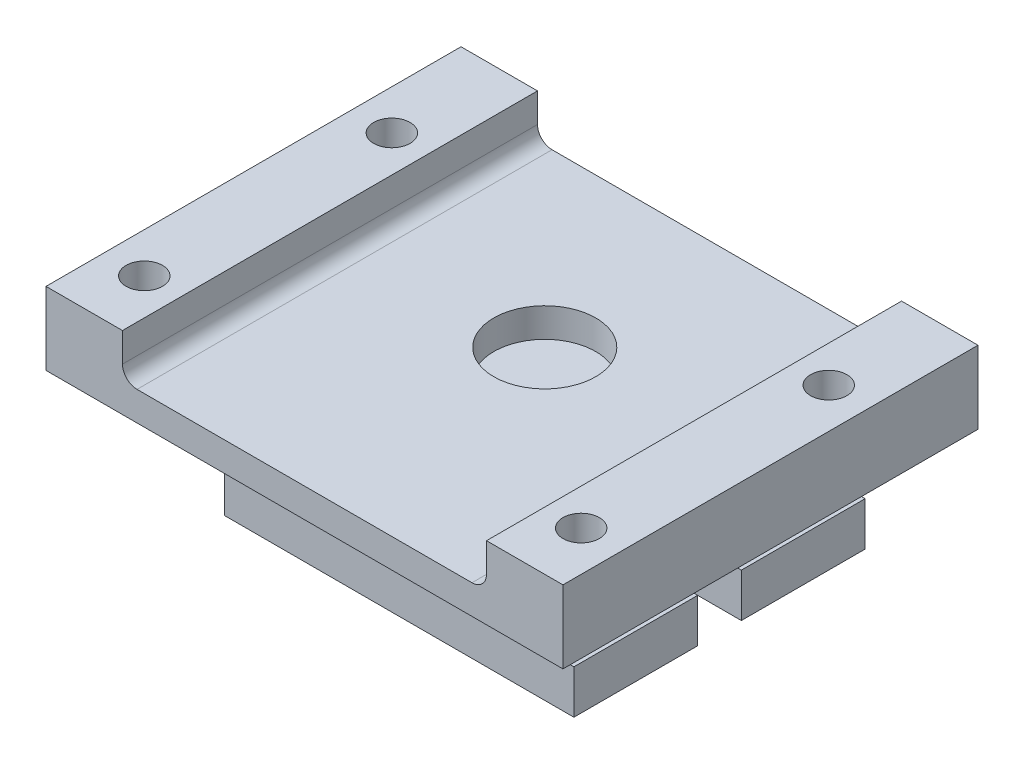
ISO-10303-21;
HEADER;
FILE_DESCRIPTION(('STEP AP214'),'2;1');
FILE_NAME('part.step','',(''),(''),'','','');
FILE_SCHEMA(('AUTOMOTIVE_DESIGN { 1 0 10303 214 1 1 1 1 }'));
ENDSEC;
DATA;
#1=APPLICATION_CONTEXT('core data for automotive mechanical design processes');
#2=APPLICATION_PROTOCOL_DEFINITION('international standard','automotive_design',2000,#1);
#3=PRODUCT_CONTEXT('',#1,'mechanical');
#4=PRODUCT('Part','Part','',(#3));
#5=PRODUCT_RELATED_PRODUCT_CATEGORY('part','',(#4));
#6=PRODUCT_DEFINITION_FORMATION('','',#4);
#7=PRODUCT_DEFINITION_CONTEXT('part definition',#1,'design');
#8=PRODUCT_DEFINITION('design','',#6,#7);
#9=PRODUCT_DEFINITION_SHAPE('','',#8);
#10=(LENGTH_UNIT() NAMED_UNIT(*) SI_UNIT(.MILLI.,.METRE.));
#11=(NAMED_UNIT(*) PLANE_ANGLE_UNIT() SI_UNIT($,.RADIAN.));
#12=(NAMED_UNIT(*) SI_UNIT($,.STERADIAN.) SOLID_ANGLE_UNIT());
#13=UNCERTAINTY_MEASURE_WITH_UNIT(LENGTH_MEASURE(1.E-05),#10,'distance_accuracy_value','');
#14=(GEOMETRIC_REPRESENTATION_CONTEXT(3) GLOBAL_UNCERTAINTY_ASSIGNED_CONTEXT((#13)) GLOBAL_UNIT_ASSIGNED_CONTEXT((#10,
#11,#12)) REPRESENTATION_CONTEXT('',''));
#15=CARTESIAN_POINT('',(0.,0.,0.));
#16=DIRECTION('',(0.,0.,1.));
#17=DIRECTION('',(1.,0.,0.));
#18=AXIS2_PLACEMENT_3D('',#15,#16,#17);
#19=CARTESIAN_POINT('',(0.,-9.,0.));
#20=DIRECTION('',(0.,-1.,0.));
#21=DIRECTION('',(0.,0.,-1.));
#22=AXIS2_PLACEMENT_3D('',#19,#20,#21);
#23=PLANE('',#22);
#24=DIRECTION('',(-1.,0.,0.));
#25=VECTOR('',#24,1.);
#26=CARTESIAN_POINT('',(17.75,-9.,1.5));
#27=LINE('',#26,#25);
#28=CARTESIAN_POINT('',(12.,-9.,1.5));
#29=VERTEX_POINT('',#28);
#30=CARTESIAN_POINT('',(-12.,-9.,1.5));
#31=VERTEX_POINT('',#30);
#32=EDGE_CURVE('E277',#29,#31,#27,.T.);
#33=ORIENTED_EDGE('',*,*,#32,.F.);
#34=DIRECTION('',(0.,0.,-1.));
#35=VECTOR('',#34,1.);
#36=CARTESIAN_POINT('',(12.,-9.,16.5));
#37=LINE('',#36,#35);
#38=CARTESIAN_POINT('',(12.,-9.,10.));
#39=VERTEX_POINT('',#38);
#40=EDGE_CURVE('E317',#39,#29,#37,.T.);
#41=ORIENTED_EDGE('',*,*,#40,.F.);
#42=DIRECTION('',(1.,0.,0.));
#43=VECTOR('',#42,1.);
#44=CARTESIAN_POINT('',(0.,-9.,9.99999999999999));
#45=LINE('',#44,#43);
#46=CARTESIAN_POINT('',(-12.,-9.,10.));
#47=VERTEX_POINT('',#46);
#48=EDGE_CURVE('E324',#47,#39,#45,.T.);
#49=ORIENTED_EDGE('',*,*,#48,.F.);
#50=DIRECTION('',(0.,0.,-1.));
#51=VECTOR('',#50,1.);
#52=CARTESIAN_POINT('',(-12.,-9.,16.5));
#53=LINE('',#52,#51);
#54=EDGE_CURVE('E297',#47,#31,#53,.T.);
#55=ORIENTED_EDGE('',*,*,#54,.T.);
#56=EDGE_LOOP('',(#33,#41,#49,#55));
#57=FACE_BOUND('',#56,.T.);
#58=ADVANCED_FACE('F80',(#57),#23,.T.);
#59=CARTESIAN_POINT('',(0.,-5.99999999999999,16.5));
#60=DIRECTION('',(0.,-1.,0.));
#61=DIRECTION('',(1.,0.,0.));
#62=AXIS2_PLACEMENT_3D('',#59,#60,#61);
#63=PLANE('',#62);
#64=DIRECTION('',(0.,0.,-1.));
#65=VECTOR('',#64,1.);
#66=CARTESIAN_POINT('',(-9.,-6.,16.5));
#67=LINE('',#66,#65);
#68=CARTESIAN_POINT('',(-9.,-6.,10.));
#69=VERTEX_POINT('',#68);
#70=CARTESIAN_POINT('',(-9.,-6.,1.5));
#71=VERTEX_POINT('',#70);
#72=EDGE_CURVE('E288',#69,#71,#67,.T.);
#73=ORIENTED_EDGE('',*,*,#72,.T.);
#74=DIRECTION('',(-1.,0.,0.));
#75=VECTOR('',#74,1.);
#76=CARTESIAN_POINT('',(17.75,-6.,1.5));
#77=LINE('',#76,#75);
#78=CARTESIAN_POINT('',(-12.,-6.,1.5));
#79=VERTEX_POINT('',#78);
#80=EDGE_CURVE('E274',#71,#79,#77,.T.);
#81=ORIENTED_EDGE('',*,*,#80,.T.);
#82=DIRECTION('',(0.,0.,-1.));
#83=VECTOR('',#82,1.);
#84=CARTESIAN_POINT('',(-12.,-6.,16.5));
#85=LINE('',#84,#83);
#86=CARTESIAN_POINT('',(-12.,-6.,10.));
#87=VERTEX_POINT('',#86);
#88=EDGE_CURVE('E286',#87,#79,#85,.T.);
#89=ORIENTED_EDGE('',*,*,#88,.F.);
#90=DIRECTION('',(1.,0.,0.));
#91=VECTOR('',#90,1.);
#92=CARTESIAN_POINT('',(0.,-5.99999999999999,9.99999999999999));
#93=LINE('',#92,#91);
#94=EDGE_CURVE('E443',#87,#69,#93,.T.);
#95=ORIENTED_EDGE('',*,*,#94,.T.);
#96=EDGE_LOOP('',(#73,#81,#89,#95));
#97=FACE_BOUND('',#96,.T.);
#98=ADVANCED_FACE('F285',(#97),#63,.F.);
#99=CARTESIAN_POINT('',(-12.,0.,16.5));
#100=DIRECTION('',(1.,0.,0.));
#101=DIRECTION('',(0.,0.,-1.));
#102=AXIS2_PLACEMENT_3D('',#99,#100,#101);
#103=PLANE('',#102);
#104=ORIENTED_EDGE('',*,*,#88,.T.);
#105=DIRECTION('',(0.,1.,0.));
#106=VECTOR('',#105,1.);
#107=CARTESIAN_POINT('',(-12.,-9.,1.5));
#108=LINE('',#107,#106);
#109=EDGE_CURVE('E271',#31,#79,#108,.T.);
#110=ORIENTED_EDGE('',*,*,#109,.F.);
#111=ORIENTED_EDGE('',*,*,#54,.F.);
#112=DIRECTION('',(0.,1.,0.));
#113=VECTOR('',#112,1.);
#114=CARTESIAN_POINT('',(-12.,-9.,9.99999999999999));
#115=LINE('',#114,#113);
#116=EDGE_CURVE('E293',#47,#87,#115,.T.);
#117=ORIENTED_EDGE('',*,*,#116,.T.);
#118=EDGE_LOOP('',(#104,#110,#111,#117));
#119=FACE_BOUND('',#118,.T.);
#120=ADVANCED_FACE('F291',(#119),#103,.F.);
#121=CARTESIAN_POINT('',(0.,-5.99999999999999,16.5));
#122=DIRECTION('',(0.,-1.,0.));
#123=DIRECTION('',(1.,0.,0.));
#124=AXIS2_PLACEMENT_3D('',#121,#122,#123);
#125=PLANE('',#124);
#126=DIRECTION('',(0.,0.,-1.));
#127=VECTOR('',#126,1.);
#128=CARTESIAN_POINT('',(12.,-6.,16.5));
#129=LINE('',#128,#127);
#130=CARTESIAN_POINT('',(12.,-6.,10.));
#131=VERTEX_POINT('',#130);
#132=CARTESIAN_POINT('',(12.,-6.,1.5));
#133=VERTEX_POINT('',#132);
#134=EDGE_CURVE('E312',#131,#133,#129,.T.);
#135=ORIENTED_EDGE('',*,*,#134,.T.);
#136=CARTESIAN_POINT('',(8.99999999999999,-6.,1.5));
#137=VERTEX_POINT('',#136);
#138=EDGE_CURVE('E289',#133,#137,#77,.T.);
#139=ORIENTED_EDGE('',*,*,#138,.T.);
#140=DIRECTION('',(0.,0.,-1.));
#141=VECTOR('',#140,1.);
#142=CARTESIAN_POINT('',(8.99999999999999,-6.,16.5));
#143=LINE('',#142,#141);
#144=CARTESIAN_POINT('',(8.99999999999999,-6.,10.));
#145=VERTEX_POINT('',#144);
#146=EDGE_CURVE('E321',#145,#137,#143,.T.);
#147=ORIENTED_EDGE('',*,*,#146,.F.);
#148=DIRECTION('',(1.,0.,0.));
#149=VECTOR('',#148,1.);
#150=CARTESIAN_POINT('',(0.,-5.99999999999999,9.99999999999999));
#151=LINE('',#150,#149);
#152=EDGE_CURVE('E438',#145,#131,#151,.T.);
#153=ORIENTED_EDGE('',*,*,#152,.T.);
#154=EDGE_LOOP('',(#135,#139,#147,#153));
#155=FACE_BOUND('',#154,.T.);
#156=ADVANCED_FACE('F504',(#155),#125,.F.);
#157=CARTESIAN_POINT('',(12.,0.,16.5));
#158=DIRECTION('',(-1.,0.,0.));
#159=DIRECTION('',(0.,0.,1.));
#160=AXIS2_PLACEMENT_3D('',#157,#158,#159);
#161=PLANE('',#160);
#162=ORIENTED_EDGE('',*,*,#40,.T.);
#163=DIRECTION('',(0.,1.,0.));
#164=VECTOR('',#163,1.);
#165=CARTESIAN_POINT('',(12.,0.,1.5));
#166=LINE('',#165,#164);
#167=EDGE_CURVE('E451',#29,#133,#166,.T.);
#168=ORIENTED_EDGE('',*,*,#167,.T.);
#169=ORIENTED_EDGE('',*,*,#134,.F.);
#170=DIRECTION('',(0.,-1.,0.));
#171=VECTOR('',#170,1.);
#172=CARTESIAN_POINT('',(12.,-9.,9.99999999999999));
#173=LINE('',#172,#171);
#174=EDGE_CURVE('E440',#131,#39,#173,.T.);
#175=ORIENTED_EDGE('',*,*,#174,.T.);
#176=EDGE_LOOP('',(#162,#168,#169,#175));
#177=FACE_BOUND('',#176,.T.);
#178=ADVANCED_FACE('F597',(#177),#161,.F.);
#179=CARTESIAN_POINT('',(0.,5.,0.));
#180=DIRECTION('',(0.,1.,0.));
#181=DIRECTION('',(0.,0.,1.));
#182=AXIS2_PLACEMENT_3D('',#179,#180,#181);
#183=PLANE('',#182);
#184=DIRECTION('',(0.,0.,-1.));
#185=VECTOR('',#184,1.);
#186=CARTESIAN_POINT('',(12.5,5.,16.5));
#187=LINE('',#186,#185);
#188=CARTESIAN_POINT('',(12.5,5.,16.5));
#189=VERTEX_POINT('',#188);
#190=CARTESIAN_POINT('',(12.5,5.,-12.));
#191=VERTEX_POINT('',#190);
#192=EDGE_CURVE('E340',#189,#191,#187,.T.);
#193=ORIENTED_EDGE('',*,*,#192,.F.);
#194=DIRECTION('',(1.,0.,0.));
#195=VECTOR('',#194,1.);
#196=CARTESIAN_POINT('',(-17.75,5.,16.5));
#197=LINE('',#196,#195);
#198=CARTESIAN_POINT('',(17.75,5.,16.5));
#199=VERTEX_POINT('',#198);
#200=EDGE_CURVE('E395',#189,#199,#197,.T.);
#201=ORIENTED_EDGE('',*,*,#200,.T.);
#202=DIRECTION('',(0.,0.,-1.));
#203=VECTOR('',#202,1.);
#204=CARTESIAN_POINT('',(17.75,5.,-12.));
#205=LINE('',#204,#203);
#206=CARTESIAN_POINT('',(17.75,5.,-12.));
#207=VERTEX_POINT('',#206);
#208=EDGE_CURVE('E385',#199,#207,#205,.T.);
#209=ORIENTED_EDGE('',*,*,#208,.T.);
#210=DIRECTION('',(-1.,0.,0.));
#211=VECTOR('',#210,1.);
#212=CARTESIAN_POINT('',(-17.75,5.,-12.));
#213=LINE('',#212,#211);
#214=EDGE_CURVE('E390',#207,#191,#213,.T.);
#215=ORIENTED_EDGE('',*,*,#214,.T.);
#216=EDGE_LOOP('',(#193,#201,#209,#215));
#217=FACE_BOUND('',#216,.T.);
#218=CARTESIAN_POINT('',(15.,5.,12.5));
#219=DIRECTION('',(0.,1.,0.));
#220=DIRECTION('',(0.,0.,1.));
#221=AXIS2_PLACEMENT_3D('',#218,#219,#220);
#222=CIRCLE('',#221,1.25);
#223=CARTESIAN_POINT('',(15.,5.,13.75));
#224=VERTEX_POINT('',#223);
#225=EDGE_CURVE('E361',#224,#224,#222,.T.);
#226=ORIENTED_EDGE('',*,*,#225,.F.);
#227=EDGE_LOOP('',(#226));
#228=FACE_BOUND('',#227,.T.);
#229=CARTESIAN_POINT('',(15.,5.,-4.5));
#230=DIRECTION('',(0.,1.,0.));
#231=DIRECTION('',(0.,0.,1.));
#232=AXIS2_PLACEMENT_3D('',#229,#230,#231);
#233=CIRCLE('',#232,1.25);
#234=CARTESIAN_POINT('',(15.,5.,-3.25));
#235=VERTEX_POINT('',#234);
#236=EDGE_CURVE('E373',#235,#235,#233,.T.);
#237=ORIENTED_EDGE('',*,*,#236,.F.);
#238=EDGE_LOOP('',(#237));
#239=FACE_BOUND('',#238,.T.);
#240=ADVANCED_FACE('F599',(#217,#228,#239),#183,.T.);
#241=DIRECTION('',(0.,0.,1.));
#242=VECTOR('',#241,1.);
#243=CARTESIAN_POINT('',(-12.5,5.,16.5));
#244=LINE('',#243,#242);
#245=CARTESIAN_POINT('',(-12.5,5.,-12.));
#246=VERTEX_POINT('',#245);
#247=CARTESIAN_POINT('',(-12.5,5.,16.5));
#248=VERTEX_POINT('',#247);
#249=EDGE_CURVE('E345',#246,#248,#244,.T.);
#250=ORIENTED_EDGE('',*,*,#249,.F.);
#251=CARTESIAN_POINT('',(-17.75,5.,-12.));
#252=VERTEX_POINT('',#251);
#253=EDGE_CURVE('E388',#246,#252,#213,.T.);
#254=ORIENTED_EDGE('',*,*,#253,.T.);
#255=DIRECTION('',(0.,0.,1.));
#256=VECTOR('',#255,1.);
#257=CARTESIAN_POINT('',(-17.75,5.,-12.));
#258=LINE('',#257,#256);
#259=CARTESIAN_POINT('',(-17.75,5.,16.5));
#260=VERTEX_POINT('',#259);
#261=EDGE_CURVE('E393',#252,#260,#258,.T.);
#262=ORIENTED_EDGE('',*,*,#261,.T.);
#263=EDGE_CURVE('E396',#260,#248,#197,.T.);
#264=ORIENTED_EDGE('',*,*,#263,.T.);
#265=EDGE_LOOP('',(#250,#254,#262,#264));
#266=FACE_BOUND('',#265,.T.);
#267=CARTESIAN_POINT('',(-15.,5.,12.5));
#268=DIRECTION('',(0.,1.,0.));
#269=DIRECTION('',(0.,0.,1.));
#270=AXIS2_PLACEMENT_3D('',#267,#268,#269);
#271=CIRCLE('',#270,1.25);
#272=CARTESIAN_POINT('',(-15.,5.,13.75));
#273=VERTEX_POINT('',#272);
#274=EDGE_CURVE('E367',#273,#273,#271,.T.);
#275=ORIENTED_EDGE('',*,*,#274,.F.);
#276=EDGE_LOOP('',(#275));
#277=FACE_BOUND('',#276,.T.);
#278=CARTESIAN_POINT('',(-15.,5.,-4.5));
#279=DIRECTION('',(0.,1.,0.));
#280=DIRECTION('',(0.,0.,1.));
#281=AXIS2_PLACEMENT_3D('',#278,#279,#280);
#282=CIRCLE('',#281,1.25);
#283=CARTESIAN_POINT('',(-15.,5.,-3.25));
#284=VERTEX_POINT('',#283);
#285=EDGE_CURVE('E379',#284,#284,#282,.T.);
#286=ORIENTED_EDGE('',*,*,#285,.F.);
#287=EDGE_LOOP('',(#286));
#288=FACE_BOUND('',#287,.T.);
#289=ADVANCED_FACE('F605',(#266,#277,#288),#183,.T.);
#290=CARTESIAN_POINT('',(0.,0.,0.));
#291=DIRECTION('',(0.,1.,0.));
#292=DIRECTION('',(0.,0.,1.));
#293=AXIS2_PLACEMENT_3D('',#290,#291,#292);
#294=PLANE('',#293);
#295=DIRECTION('',(0.,0.,-1.));
#296=VECTOR('',#295,1.);
#297=CARTESIAN_POINT('',(11.,0.,-10.));
#298=LINE('',#297,#296);
#299=CARTESIAN_POINT('',(11.,0.,9.99999999999999));
#300=VERTEX_POINT('',#299);
#301=CARTESIAN_POINT('',(11.,0.,-10.));
#302=VERTEX_POINT('',#301);
#303=EDGE_CURVE('E457',#300,#302,#298,.T.);
#304=ORIENTED_EDGE('',*,*,#303,.T.);
#305=DIRECTION('',(1.,0.,0.));
#306=VECTOR('',#305,1.);
#307=CARTESIAN_POINT('',(0.,0.,-10.));
#308=LINE('',#307,#306);
#309=CARTESIAN_POINT('',(-11.,0.,-10.));
#310=VERTEX_POINT('',#309);
#311=EDGE_CURVE('E328',#310,#302,#308,.T.);
#312=ORIENTED_EDGE('',*,*,#311,.F.);
#313=DIRECTION('',(0.,0.,-1.));
#314=VECTOR('',#313,1.);
#315=CARTESIAN_POINT('',(-11.,0.,10.));
#316=LINE('',#315,#314);
#317=CARTESIAN_POINT('',(-11.,0.,9.99999999999999));
#318=VERTEX_POINT('',#317);
#319=EDGE_CURVE('E454',#310,#318,#316,.F.);
#320=ORIENTED_EDGE('',*,*,#319,.T.);
#321=DIRECTION('',(1.,0.,0.));
#322=VECTOR('',#321,1.);
#323=CARTESIAN_POINT('',(0.,0.,9.99999999999999));
#324=LINE('',#323,#322);
#325=EDGE_CURVE('E332',#318,#300,#324,.T.);
#326=ORIENTED_EDGE('',*,*,#325,.T.);
#327=EDGE_LOOP('',(#304,#312,#320,#326));
#328=FACE_BOUND('',#327,.T.);
#329=CARTESIAN_POINT('',(-15.,0.,12.5));
#330=DIRECTION('',(0.,1.,0.));
#331=DIRECTION('',(0.,0.,1.));
#332=AXIS2_PLACEMENT_3D('',#329,#330,#331);
#333=CIRCLE('',#332,1.25);
#334=CARTESIAN_POINT('',(-15.,0.,13.75));
#335=VERTEX_POINT('',#334);
#336=EDGE_CURVE('E364',#335,#335,#333,.T.);
#337=ORIENTED_EDGE('',*,*,#336,.T.);
#338=EDGE_LOOP('',(#337));
#339=FACE_BOUND('',#338,.T.);
#340=DIRECTION('',(0.,0.,-1.));
#341=VECTOR('',#340,1.);
#342=CARTESIAN_POINT('',(17.75,0.,-12.));
#343=LINE('',#342,#341);
#344=CARTESIAN_POINT('',(17.75,0.,16.5));
#345=VERTEX_POINT('',#344);
#346=CARTESIAN_POINT('',(17.75,0.,-12.));
#347=VERTEX_POINT('',#346);
#348=EDGE_CURVE('E382',#345,#347,#343,.T.);
#349=ORIENTED_EDGE('',*,*,#348,.F.);
#350=DIRECTION('',(1.,0.,0.));
#351=VECTOR('',#350,1.);
#352=CARTESIAN_POINT('',(-17.75,0.,16.5));
#353=LINE('',#352,#351);
#354=CARTESIAN_POINT('',(-17.75,0.,16.5));
#355=VERTEX_POINT('',#354);
#356=EDGE_CURVE('E389',#355,#345,#353,.T.);
#357=ORIENTED_EDGE('',*,*,#356,.F.);
#358=DIRECTION('',(0.,0.,1.));
#359=VECTOR('',#358,1.);
#360=CARTESIAN_POINT('',(-17.75,0.,-12.));
#361=LINE('',#360,#359);
#362=CARTESIAN_POINT('',(-17.75,0.,-12.));
#363=VERTEX_POINT('',#362);
#364=EDGE_CURVE('E404',#363,#355,#361,.T.);
#365=ORIENTED_EDGE('',*,*,#364,.F.);
#366=DIRECTION('',(-1.,0.,0.));
#367=VECTOR('',#366,1.);
#368=CARTESIAN_POINT('',(-17.75,0.,-12.));
#369=LINE('',#368,#367);
#370=EDGE_CURVE('E402',#347,#363,#369,.T.);
#371=ORIENTED_EDGE('',*,*,#370,.F.);
#372=EDGE_LOOP('',(#349,#357,#365,#371));
#373=FACE_BOUND('',#372,.T.);
#374=CARTESIAN_POINT('',(15.,0.,12.5));
#375=DIRECTION('',(0.,1.,0.));
#376=DIRECTION('',(0.,0.,1.));
#377=AXIS2_PLACEMENT_3D('',#374,#375,#376);
#378=CIRCLE('',#377,1.25);
#379=CARTESIAN_POINT('',(15.,0.,13.75));
#380=VERTEX_POINT('',#379);
#381=EDGE_CURVE('E355',#380,#380,#378,.T.);
#382=ORIENTED_EDGE('',*,*,#381,.T.);
#383=EDGE_LOOP('',(#382));
#384=FACE_BOUND('',#383,.T.);
#385=CARTESIAN_POINT('',(15.,0.,-4.5));
#386=DIRECTION('',(0.,1.,0.));
#387=DIRECTION('',(0.,0.,1.));
#388=AXIS2_PLACEMENT_3D('',#385,#386,#387);
#389=CIRCLE('',#388,1.25);
#390=CARTESIAN_POINT('',(15.,0.,-3.25));
#391=VERTEX_POINT('',#390);
#392=EDGE_CURVE('E370',#391,#391,#389,.T.);
#393=ORIENTED_EDGE('',*,*,#392,.T.);
#394=EDGE_LOOP('',(#393));
#395=FACE_BOUND('',#394,.T.);
#396=CARTESIAN_POINT('',(-15.,0.,-4.5));
#397=DIRECTION('',(0.,1.,0.));
#398=DIRECTION('',(0.,0.,1.));
#399=AXIS2_PLACEMENT_3D('',#396,#397,#398);
#400=CIRCLE('',#399,1.25);
#401=CARTESIAN_POINT('',(-15.,0.,-3.25));
#402=VERTEX_POINT('',#401);
#403=EDGE_CURVE('E376',#402,#402,#400,.T.);
#404=ORIENTED_EDGE('',*,*,#403,.T.);
#405=EDGE_LOOP('',(#404));
#406=FACE_BOUND('',#405,.T.);
#407=ADVANCED_FACE('F677',(#328,#339,#373,#384,#395,#406),#294,.F.);
#408=CARTESIAN_POINT('',(17.75,5.,-12.));
#409=DIRECTION('',(-1.,0.,0.));
#410=DIRECTION('',(0.,0.,1.));
#411=AXIS2_PLACEMENT_3D('',#408,#409,#410);
#412=PLANE('',#411);
#413=ORIENTED_EDGE('',*,*,#348,.T.);
#414=DIRECTION('',(0.,-1.,0.));
#415=VECTOR('',#414,1.);
#416=CARTESIAN_POINT('',(17.75,5.,-12.));
#417=LINE('',#416,#415);
#418=EDGE_CURVE('E415',#207,#347,#417,.T.);
#419=ORIENTED_EDGE('',*,*,#418,.F.);
#420=ORIENTED_EDGE('',*,*,#208,.F.);
#421=DIRECTION('',(0.,-1.,0.));
#422=VECTOR('',#421,1.);
#423=CARTESIAN_POINT('',(17.75,5.,16.5));
#424=LINE('',#423,#422);
#425=EDGE_CURVE('E399',#199,#345,#424,.T.);
#426=ORIENTED_EDGE('',*,*,#425,.T.);
#427=EDGE_LOOP('',(#413,#419,#420,#426));
#428=FACE_BOUND('',#427,.T.);
#429=ADVANCED_FACE('F681',(#428),#412,.F.);
#430=CARTESIAN_POINT('',(-17.75,5.,-12.));
#431=DIRECTION('',(0.,0.,1.));
#432=DIRECTION('',(1.,0.,0.));
#433=AXIS2_PLACEMENT_3D('',#430,#431,#432);
#434=PLANE('',#433);
#435=DIRECTION('',(-1.,0.,0.));
#436=VECTOR('',#435,1.);
#437=CARTESIAN_POINT('',(12.5,2.,-12.));
#438=LINE('',#437,#436);
#439=CARTESIAN_POINT('',(11.5,2.,-12.));
#440=VERTEX_POINT('',#439);
#441=CARTESIAN_POINT('',(-11.5,2.,-12.));
#442=VERTEX_POINT('',#441);
#443=EDGE_CURVE('E341',#440,#442,#438,.T.);
#444=ORIENTED_EDGE('',*,*,#443,.F.);
#445=CARTESIAN_POINT('',(11.5,3.,-12.));
#446=DIRECTION('',(0.,0.,1.));
#447=DIRECTION('',(1.,0.,0.));
#448=AXIS2_PLACEMENT_3D('',#445,#446,#447);
#449=CIRCLE('',#448,1.);
#450=CARTESIAN_POINT('',(12.5,3.,-12.));
#451=VERTEX_POINT('',#450);
#452=EDGE_CURVE('E428',#440,#451,#449,.T.);
#453=ORIENTED_EDGE('',*,*,#452,.T.);
#454=DIRECTION('',(0.,1.,0.));
#455=VECTOR('',#454,1.);
#456=CARTESIAN_POINT('',(12.5,2.,-12.));
#457=LINE('',#456,#455);
#458=EDGE_CURVE('E348',#451,#191,#457,.T.);
#459=ORIENTED_EDGE('',*,*,#458,.T.);
#460=ORIENTED_EDGE('',*,*,#214,.F.);
#461=ORIENTED_EDGE('',*,*,#418,.T.);
#462=ORIENTED_EDGE('',*,*,#370,.T.);
#463=DIRECTION('',(0.,-1.,0.));
#464=VECTOR('',#463,1.);
#465=CARTESIAN_POINT('',(-17.75,5.,-12.));
#466=LINE('',#465,#464);
#467=EDGE_CURVE('E412',#252,#363,#466,.T.);
#468=ORIENTED_EDGE('',*,*,#467,.F.);
#469=ORIENTED_EDGE('',*,*,#253,.F.);
#470=DIRECTION('',(0.,1.,0.));
#471=VECTOR('',#470,1.);
#472=CARTESIAN_POINT('',(-12.5,2.,-12.));
#473=LINE('',#472,#471);
#474=CARTESIAN_POINT('',(-12.5,3.,-12.));
#475=VERTEX_POINT('',#474);
#476=EDGE_CURVE('E358',#475,#246,#473,.T.);
#477=ORIENTED_EDGE('',*,*,#476,.F.);
#478=CARTESIAN_POINT('',(-11.5,3.,-12.));
#479=DIRECTION('',(0.,0.,1.));
#480=DIRECTION('',(1.,0.,0.));
#481=AXIS2_PLACEMENT_3D('',#478,#479,#480);
#482=CIRCLE('',#481,1.);
#483=EDGE_CURVE('E434',#475,#442,#482,.T.);
#484=ORIENTED_EDGE('',*,*,#483,.T.);
#485=EDGE_LOOP('',(#444,#453,#459,#460,#461,#462,#468,#469,#477,#484));
#486=FACE_BOUND('',#485,.T.);
#487=ADVANCED_FACE('F913',(#486),#434,.F.);
#488=CARTESIAN_POINT('',(-17.75,5.,-12.));
#489=DIRECTION('',(1.,0.,0.));
#490=DIRECTION('',(0.,0.,-1.));
#491=AXIS2_PLACEMENT_3D('',#488,#489,#490);
#492=PLANE('',#491);
#493=ORIENTED_EDGE('',*,*,#364,.T.);
#494=DIRECTION('',(0.,-1.,0.));
#495=VECTOR('',#494,1.);
#496=CARTESIAN_POINT('',(-17.75,5.,16.5));
#497=LINE('',#496,#495);
#498=EDGE_CURVE('E409',#260,#355,#497,.T.);
#499=ORIENTED_EDGE('',*,*,#498,.F.);
#500=ORIENTED_EDGE('',*,*,#261,.F.);
#501=ORIENTED_EDGE('',*,*,#467,.T.);
#502=EDGE_LOOP('',(#493,#499,#500,#501));
#503=FACE_BOUND('',#502,.T.);
#504=ADVANCED_FACE('F846',(#503),#492,.F.);
#505=CARTESIAN_POINT('',(-17.75,5.,16.5));
#506=DIRECTION('',(0.,0.,-1.));
#507=DIRECTION('',(-1.,0.,0.));
#508=AXIS2_PLACEMENT_3D('',#505,#506,#507);
#509=PLANE('',#508);
#510=ORIENTED_EDGE('',*,*,#200,.F.);
#511=DIRECTION('',(0.,1.,0.));
#512=VECTOR('',#511,1.);
#513=CARTESIAN_POINT('',(12.5,2.,16.5));
#514=LINE('',#513,#512);
#515=CARTESIAN_POINT('',(12.5,3.,16.5));
#516=VERTEX_POINT('',#515);
#517=EDGE_CURVE('E353',#516,#189,#514,.T.);
#518=ORIENTED_EDGE('',*,*,#517,.F.);
#519=CARTESIAN_POINT('',(11.5,3.,16.5));
#520=DIRECTION('',(0.,0.,-1.));
#521=DIRECTION('',(-1.,0.,0.));
#522=AXIS2_PLACEMENT_3D('',#519,#520,#521);
#523=CIRCLE('',#522,1.);
#524=CARTESIAN_POINT('',(11.5,2.,16.5));
#525=VERTEX_POINT('',#524);
#526=EDGE_CURVE('E430',#516,#525,#523,.T.);
#527=ORIENTED_EDGE('',*,*,#526,.T.);
#528=DIRECTION('',(1.,0.,0.));
#529=VECTOR('',#528,1.);
#530=CARTESIAN_POINT('',(12.5,2.,16.5));
#531=LINE('',#530,#529);
#532=CARTESIAN_POINT('',(-11.5,2.,16.5));
#533=VERTEX_POINT('',#532);
#534=EDGE_CURVE('E344',#533,#525,#531,.T.);
#535=ORIENTED_EDGE('',*,*,#534,.F.);
#536=CARTESIAN_POINT('',(-11.5,3.,16.5));
#537=DIRECTION('',(0.,0.,-1.));
#538=DIRECTION('',(-1.,0.,0.));
#539=AXIS2_PLACEMENT_3D('',#536,#537,#538);
#540=CIRCLE('',#539,1.);
#541=CARTESIAN_POINT('',(-12.5,3.,16.5));
#542=VERTEX_POINT('',#541);
#543=EDGE_CURVE('E432',#533,#542,#540,.T.);
#544=ORIENTED_EDGE('',*,*,#543,.T.);
#545=DIRECTION('',(0.,1.,0.));
#546=VECTOR('',#545,1.);
#547=CARTESIAN_POINT('',(-12.5,2.,16.5));
#548=LINE('',#547,#546);
#549=EDGE_CURVE('E356',#542,#248,#548,.T.);
#550=ORIENTED_EDGE('',*,*,#549,.T.);
#551=ORIENTED_EDGE('',*,*,#263,.F.);
#552=ORIENTED_EDGE('',*,*,#498,.T.);
#553=ORIENTED_EDGE('',*,*,#356,.T.);
#554=ORIENTED_EDGE('',*,*,#425,.F.);
#555=EDGE_LOOP('',(#510,#518,#527,#535,#544,#550,#551,#552,#553,#554));
#556=FACE_BOUND('',#555,.T.);
#557=ADVANCED_FACE('F835',(#556),#509,.F.);
#558=CARTESIAN_POINT('',(-15.,5.,-4.5));
#559=DIRECTION('',(0.,-1.,0.));
#560=DIRECTION('',(0.,0.,-1.));
#561=AXIS2_PLACEMENT_3D('',#558,#559,#560);
#562=CYLINDRICAL_SURFACE('',#561,1.25);
#563=ORIENTED_EDGE('',*,*,#285,.T.);
#564=EDGE_LOOP('',(#563));
#565=FACE_BOUND('',#564,.T.);
#566=ORIENTED_EDGE('',*,*,#403,.F.);
#567=EDGE_LOOP('',(#566));
#568=FACE_BOUND('',#567,.T.);
#569=ADVANCED_FACE('F824',(#565,#568),#562,.F.);
#570=CARTESIAN_POINT('',(15.,5.,-4.5));
#571=DIRECTION('',(0.,-1.,0.));
#572=DIRECTION('',(0.,0.,-1.));
#573=AXIS2_PLACEMENT_3D('',#570,#571,#572);
#574=CYLINDRICAL_SURFACE('',#573,1.25);
#575=ORIENTED_EDGE('',*,*,#236,.T.);
#576=EDGE_LOOP('',(#575));
#577=FACE_BOUND('',#576,.T.);
#578=ORIENTED_EDGE('',*,*,#392,.F.);
#579=EDGE_LOOP('',(#578));
#580=FACE_BOUND('',#579,.T.);
#581=ADVANCED_FACE('F813',(#577,#580),#574,.F.);
#582=CARTESIAN_POINT('',(-15.,5.,12.5));
#583=DIRECTION('',(0.,-1.,0.));
#584=DIRECTION('',(0.,0.,-1.));
#585=AXIS2_PLACEMENT_3D('',#582,#583,#584);
#586=CYLINDRICAL_SURFACE('',#585,1.25);
#587=ORIENTED_EDGE('',*,*,#274,.T.);
#588=EDGE_LOOP('',(#587));
#589=FACE_BOUND('',#588,.T.);
#590=ORIENTED_EDGE('',*,*,#336,.F.);
#591=EDGE_LOOP('',(#590));
#592=FACE_BOUND('',#591,.T.);
#593=ADVANCED_FACE('F800',(#589,#592),#586,.F.);
#594=CARTESIAN_POINT('',(15.,5.,12.5));
#595=DIRECTION('',(0.,-1.,0.));
#596=DIRECTION('',(0.,0.,-1.));
#597=AXIS2_PLACEMENT_3D('',#594,#595,#596);
#598=CYLINDRICAL_SURFACE('',#597,1.25);
#599=ORIENTED_EDGE('',*,*,#225,.T.);
#600=EDGE_LOOP('',(#599));
#601=FACE_BOUND('',#600,.T.);
#602=ORIENTED_EDGE('',*,*,#381,.F.);
#603=EDGE_LOOP('',(#602));
#604=FACE_BOUND('',#603,.T.);
#605=ADVANCED_FACE('F794',(#601,#604),#598,.F.);
#606=CARTESIAN_POINT('',(12.5,2.,16.5));
#607=DIRECTION('',(1.,0.,0.));
#608=DIRECTION('',(0.,0.,-1.));
#609=AXIS2_PLACEMENT_3D('',#606,#607,#608);
#610=PLANE('',#609);
#611=ORIENTED_EDGE('',*,*,#458,.F.);
#612=DIRECTION('',(0.,0.,-1.));
#613=VECTOR('',#612,1.);
#614=CARTESIAN_POINT('',(12.5,3.,16.5));
#615=LINE('',#614,#613);
#616=EDGE_CURVE('E424',#451,#516,#615,.F.);
#617=ORIENTED_EDGE('',*,*,#616,.T.);
#618=ORIENTED_EDGE('',*,*,#517,.T.);
#619=ORIENTED_EDGE('',*,*,#192,.T.);
#620=EDGE_LOOP('',(#611,#617,#618,#619));
#621=FACE_BOUND('',#620,.T.);
#622=ADVANCED_FACE('F799',(#621),#610,.F.);
#623=CARTESIAN_POINT('',(-12.5,2.,16.5));
#624=DIRECTION('',(-1.,0.,0.));
#625=DIRECTION('',(0.,0.,1.));
#626=AXIS2_PLACEMENT_3D('',#623,#624,#625);
#627=PLANE('',#626);
#628=ORIENTED_EDGE('',*,*,#549,.F.);
#629=DIRECTION('',(0.,0.,1.));
#630=VECTOR('',#629,1.);
#631=CARTESIAN_POINT('',(-12.5,3.,16.5));
#632=LINE('',#631,#630);
#633=EDGE_CURVE('E426',#542,#475,#632,.F.);
#634=ORIENTED_EDGE('',*,*,#633,.T.);
#635=ORIENTED_EDGE('',*,*,#476,.T.);
#636=ORIENTED_EDGE('',*,*,#249,.T.);
#637=EDGE_LOOP('',(#628,#634,#635,#636));
#638=FACE_BOUND('',#637,.T.);
#639=ADVANCED_FACE('F887',(#638),#627,.F.);
#640=CARTESIAN_POINT('',(0.,2.,0.));
#641=DIRECTION('',(0.,1.,0.));
#642=DIRECTION('',(0.,0.,1.));
#643=AXIS2_PLACEMENT_3D('',#640,#641,#642);
#644=PLANE('',#643);
#645=CARTESIAN_POINT('',(0.,2.,0.));
#646=DIRECTION('',(0.,1.,0.));
#647=DIRECTION('',(0.,0.,1.));
#648=AXIS2_PLACEMENT_3D('',#645,#646,#647);
#649=CIRCLE('',#648,3.5);
#650=CARTESIAN_POINT('',(0.,2.,3.5));
#651=VERTEX_POINT('',#650);
#652=EDGE_CURVE('E337',#651,#651,#649,.T.);
#653=ORIENTED_EDGE('',*,*,#652,.F.);
#654=EDGE_LOOP('',(#653));
#655=FACE_BOUND('',#654,.T.);
#656=ORIENTED_EDGE('',*,*,#534,.T.);
#657=DIRECTION('',(0.,0.,-1.));
#658=VECTOR('',#657,1.);
#659=CARTESIAN_POINT('',(11.5,2.,0.));
#660=LINE('',#659,#658);
#661=EDGE_CURVE('E421',#525,#440,#660,.T.);
#662=ORIENTED_EDGE('',*,*,#661,.T.);
#663=ORIENTED_EDGE('',*,*,#443,.T.);
#664=DIRECTION('',(0.,0.,1.));
#665=VECTOR('',#664,1.);
#666=CARTESIAN_POINT('',(-11.5,2.,0.));
#667=LINE('',#666,#665);
#668=EDGE_CURVE('E418',#442,#533,#667,.T.);
#669=ORIENTED_EDGE('',*,*,#668,.T.);
#670=EDGE_LOOP('',(#656,#662,#663,#669));
#671=FACE_BOUND('',#670,.T.);
#672=ADVANCED_FACE('F882',(#655,#671),#644,.T.);
#673=CARTESIAN_POINT('',(0.,0.,0.));
#674=DIRECTION('',(0.,1.,0.));
#675=DIRECTION('',(0.,0.,1.));
#676=AXIS2_PLACEMENT_3D('',#673,#674,#675);
#677=CYLINDRICAL_SURFACE('',#676,3.5);
#678=ORIENTED_EDGE('',*,*,#652,.T.);
#679=EDGE_LOOP('',(#678));
#680=FACE_BOUND('',#679,.T.);
#681=CARTESIAN_POINT('',(0.,0.,0.));
#682=DIRECTION('',(0.,1.,0.));
#683=DIRECTION('',(0.,0.,1.));
#684=AXIS2_PLACEMENT_3D('',#681,#682,#683);
#685=CIRCLE('',#684,3.5);
#686=CARTESIAN_POINT('',(0.,0.,3.5));
#687=VERTEX_POINT('',#686);
#688=EDGE_CURVE('E331',#687,#687,#685,.T.);
#689=ORIENTED_EDGE('',*,*,#688,.F.);
#690=EDGE_LOOP('',(#689));
#691=FACE_BOUND('',#690,.T.);
#692=ADVANCED_FACE('F873',(#680,#691),#677,.F.);
#693=CARTESIAN_POINT('',(11.5,3.,0.));
#694=DIRECTION('',(0.,0.,-1.));
#695=DIRECTION('',(-1.,0.,0.));
#696=AXIS2_PLACEMENT_3D('',#693,#694,#695);
#697=CYLINDRICAL_SURFACE('',#696,1.);
#698=ORIENTED_EDGE('',*,*,#526,.F.);
#699=ORIENTED_EDGE('',*,*,#616,.F.);
#700=ORIENTED_EDGE('',*,*,#452,.F.);
#701=ORIENTED_EDGE('',*,*,#661,.F.);
#702=EDGE_LOOP('',(#698,#699,#700,#701));
#703=FACE_BOUND('',#702,.T.);
#704=ADVANCED_FACE('F568',(#703),#697,.F.);
#705=CARTESIAN_POINT('',(-11.5,3.,0.));
#706=DIRECTION('',(0.,0.,1.));
#707=DIRECTION('',(1.,0.,0.));
#708=AXIS2_PLACEMENT_3D('',#705,#706,#707);
#709=CYLINDRICAL_SURFACE('',#708,1.);
#710=ORIENTED_EDGE('',*,*,#483,.F.);
#711=ORIENTED_EDGE('',*,*,#633,.F.);
#712=ORIENTED_EDGE('',*,*,#543,.F.);
#713=ORIENTED_EDGE('',*,*,#668,.F.);
#714=EDGE_LOOP('',(#710,#711,#712,#713));
#715=FACE_BOUND('',#714,.T.);
#716=ADVANCED_FACE('F561',(#715),#709,.F.);
#717=DIRECTION('',(-1.,0.,0.));
#718=VECTOR('',#717,1.);
#719=CARTESIAN_POINT('',(17.75,-9.,-1.5));
#720=LINE('',#719,#718);
#721=CARTESIAN_POINT('',(12.,-9.,-1.5));
#722=VERTEX_POINT('',#721);
#723=CARTESIAN_POINT('',(-12.,-9.,-1.5));
#724=VERTEX_POINT('',#723);
#725=EDGE_CURVE('E573',#722,#724,#720,.T.);
#726=ORIENTED_EDGE('',*,*,#725,.T.);
#727=CARTESIAN_POINT('',(-12.,-9.,-10.));
#728=VERTEX_POINT('',#727);
#729=EDGE_CURVE('E294',#724,#728,#53,.T.);
#730=ORIENTED_EDGE('',*,*,#729,.T.);
#731=DIRECTION('',(1.,0.,0.));
#732=VECTOR('',#731,1.);
#733=CARTESIAN_POINT('',(0.,-9.,-10.));
#734=LINE('',#733,#732);
#735=CARTESIAN_POINT('',(12.,-9.,-10.));
#736=VERTEX_POINT('',#735);
#737=EDGE_CURVE('E327',#728,#736,#734,.T.);
#738=ORIENTED_EDGE('',*,*,#737,.T.);
#739=EDGE_CURVE('E320',#722,#736,#37,.T.);
#740=ORIENTED_EDGE('',*,*,#739,.F.);
#741=EDGE_LOOP('',(#726,#730,#738,#740));
#742=FACE_BOUND('',#741,.T.);
#743=ADVANCED_FACE('F552',(#742),#23,.T.);
#744=CARTESIAN_POINT('',(0.,-9.,-10.));
#745=DIRECTION('',(0.,0.,1.));
#746=DIRECTION('',(1.,0.,0.));
#747=AXIS2_PLACEMENT_3D('',#744,#745,#746);
#748=PLANE('',#747);
#749=DIRECTION('',(-1.,0.,0.));
#750=VECTOR('',#749,1.);
#751=CARTESIAN_POINT('',(0.,-5.99999999999999,-10.));
#752=LINE('',#751,#750);
#753=CARTESIAN_POINT('',(-9.,-6.,-10.));
#754=VERTEX_POINT('',#753);
#755=CARTESIAN_POINT('',(-12.,-6.,-10.));
#756=VERTEX_POINT('',#755);
#757=EDGE_CURVE('E315',#754,#756,#752,.T.);
#758=ORIENTED_EDGE('',*,*,#757,.F.);
#759=DIRECTION('',(0.,-1.,0.));
#760=VECTOR('',#759,1.);
#761=CARTESIAN_POINT('',(-9.,0.,-10.));
#762=LINE('',#761,#760);
#763=CARTESIAN_POINT('',(-9.,-2.,-10.));
#764=VERTEX_POINT('',#763);
#765=EDGE_CURVE('E299',#764,#754,#762,.T.);
#766=ORIENTED_EDGE('',*,*,#765,.F.);
#767=CARTESIAN_POINT('',(-11.,-2.,-10.));
#768=DIRECTION('',(0.,0.,1.));
#769=DIRECTION('',(1.,0.,0.));
#770=AXIS2_PLACEMENT_3D('',#767,#768,#769);
#771=CIRCLE('',#770,2.);
#772=EDGE_CURVE('E482',#764,#310,#771,.T.);
#773=ORIENTED_EDGE('',*,*,#772,.T.);
#774=ORIENTED_EDGE('',*,*,#311,.T.);
#775=CARTESIAN_POINT('',(11.,-2.,-10.));
#776=DIRECTION('',(0.,0.,1.));
#777=DIRECTION('',(1.,0.,0.));
#778=AXIS2_PLACEMENT_3D('',#775,#776,#777);
#779=CIRCLE('',#778,2.);
#780=CARTESIAN_POINT('',(8.99999999999999,-2.,-10.));
#781=VERTEX_POINT('',#780);
#782=EDGE_CURVE('E477',#302,#781,#779,.T.);
#783=ORIENTED_EDGE('',*,*,#782,.T.);
#784=DIRECTION('',(0.,1.,0.));
#785=VECTOR('',#784,1.);
#786=CARTESIAN_POINT('',(8.99999999999999,0.,-10.));
#787=LINE('',#786,#785);
#788=CARTESIAN_POINT('',(8.99999999999999,-6.,-10.));
#789=VERTEX_POINT('',#788);
#790=EDGE_CURVE('E305',#789,#781,#787,.T.);
#791=ORIENTED_EDGE('',*,*,#790,.F.);
#792=DIRECTION('',(-1.,0.,0.));
#793=VECTOR('',#792,1.);
#794=CARTESIAN_POINT('',(0.,-5.99999999999999,-10.));
#795=LINE('',#794,#793);
#796=CARTESIAN_POINT('',(12.,-6.,-10.));
#797=VERTEX_POINT('',#796);
#798=EDGE_CURVE('E302',#797,#789,#795,.T.);
#799=ORIENTED_EDGE('',*,*,#798,.F.);
#800=DIRECTION('',(0.,1.,0.));
#801=VECTOR('',#800,1.);
#802=CARTESIAN_POINT('',(12.,0.,-10.));
#803=LINE('',#802,#801);
#804=EDGE_CURVE('E308',#736,#797,#803,.T.);
#805=ORIENTED_EDGE('',*,*,#804,.F.);
#806=ORIENTED_EDGE('',*,*,#737,.F.);
#807=DIRECTION('',(0.,-1.,0.));
#808=VECTOR('',#807,1.);
#809=CARTESIAN_POINT('',(-12.,0.,-10.));
#810=LINE('',#809,#808);
#811=EDGE_CURVE('E514',#756,#728,#810,.T.);
#812=ORIENTED_EDGE('',*,*,#811,.F.);
#813=EDGE_LOOP('',(#758,#766,#773,#774,#783,#791,#799,#805,#806,#812));
#814=FACE_BOUND('',#813,.T.);
#815=ADVANCED_FACE('F537',(#814),#748,.F.);
#816=CARTESIAN_POINT('',(0.,-9.,9.99999999999999));
#817=DIRECTION('',(0.,0.,1.));
#818=DIRECTION('',(1.,0.,0.));
#819=AXIS2_PLACEMENT_3D('',#816,#817,#818);
#820=PLANE('',#819);
#821=DIRECTION('',(0.,1.,0.));
#822=VECTOR('',#821,1.);
#823=CARTESIAN_POINT('',(-9.,-9.,9.99999999999999));
#824=LINE('',#823,#822);
#825=CARTESIAN_POINT('',(-9.,-2.,9.99999999999999));
#826=VERTEX_POINT('',#825);
#827=EDGE_CURVE('E445',#69,#826,#824,.T.);
#828=ORIENTED_EDGE('',*,*,#827,.F.);
#829=ORIENTED_EDGE('',*,*,#94,.F.);
#830=ORIENTED_EDGE('',*,*,#116,.F.);
#831=ORIENTED_EDGE('',*,*,#48,.T.);
#832=ORIENTED_EDGE('',*,*,#174,.F.);
#833=ORIENTED_EDGE('',*,*,#152,.F.);
#834=DIRECTION('',(0.,-1.,0.));
#835=VECTOR('',#834,1.);
#836=CARTESIAN_POINT('',(8.99999999999999,-9.,9.99999999999999));
#837=LINE('',#836,#835);
#838=CARTESIAN_POINT('',(8.99999999999999,-2.,9.99999999999999));
#839=VERTEX_POINT('',#838);
#840=EDGE_CURVE('E436',#839,#145,#837,.T.);
#841=ORIENTED_EDGE('',*,*,#840,.F.);
#842=CARTESIAN_POINT('',(11.,-2.,9.99999999999999));
#843=DIRECTION('',(0.,0.,1.));
#844=DIRECTION('',(1.,0.,0.));
#845=AXIS2_PLACEMENT_3D('',#842,#843,#844);
#846=CIRCLE('',#845,2.);
#847=EDGE_CURVE('E479',#839,#300,#846,.F.);
#848=ORIENTED_EDGE('',*,*,#847,.T.);
#849=ORIENTED_EDGE('',*,*,#325,.F.);
#850=CARTESIAN_POINT('',(-11.,-2.,9.99999999999999));
#851=DIRECTION('',(0.,0.,1.));
#852=DIRECTION('',(1.,0.,0.));
#853=AXIS2_PLACEMENT_3D('',#850,#851,#852);
#854=CIRCLE('',#853,2.);
#855=EDGE_CURVE('E485',#318,#826,#854,.F.);
#856=ORIENTED_EDGE('',*,*,#855,.T.);
#857=EDGE_LOOP('',(#828,#829,#830,#831,#832,#833,#841,#848,#849,#856));
#858=FACE_BOUND('',#857,.T.);
#859=ADVANCED_FACE('F528',(#858),#820,.T.);
#860=CARTESIAN_POINT('',(0.,0.,0.));
#861=DIRECTION('',(0.,-1.,0.));
#862=DIRECTION('',(0.,0.,-1.));
#863=AXIS2_PLACEMENT_3D('',#860,#861,#862);
#864=PLANE('',#863);
#865=ORIENTED_EDGE('',*,*,#688,.T.);
#866=EDGE_LOOP('',(#865));
#867=FACE_BOUND('',#866,.T.);
#868=ADVANCED_FACE('F652',(#867),#864,.F.);
#869=CARTESIAN_POINT('',(-12.,-6.,-1.5));
#870=VERTEX_POINT('',#869);
#871=EDGE_CURVE('E295',#870,#756,#85,.T.);
#872=ORIENTED_EDGE('',*,*,#871,.F.);
#873=DIRECTION('',(-1.,0.,0.));
#874=VECTOR('',#873,1.);
#875=CARTESIAN_POINT('',(17.75,-6.,-1.5));
#876=LINE('',#875,#874);
#877=CARTESIAN_POINT('',(-9.,-6.,-1.5));
#878=VERTEX_POINT('',#877);
#879=EDGE_CURVE('E507',#878,#870,#876,.T.);
#880=ORIENTED_EDGE('',*,*,#879,.F.);
#881=EDGE_CURVE('E517',#878,#754,#67,.T.);
#882=ORIENTED_EDGE('',*,*,#881,.T.);
#883=ORIENTED_EDGE('',*,*,#757,.T.);
#884=EDGE_LOOP('',(#872,#880,#882,#883));
#885=FACE_BOUND('',#884,.T.);
#886=ADVANCED_FACE('F557',(#885),#63,.F.);
#887=CARTESIAN_POINT('',(-9.,0.,16.5));
#888=DIRECTION('',(1.,0.,0.));
#889=DIRECTION('',(0.,0.,-1.));
#890=AXIS2_PLACEMENT_3D('',#887,#888,#889);
#891=PLANE('',#890);
#892=ORIENTED_EDGE('',*,*,#827,.T.);
#893=DIRECTION('',(0.,0.,-1.));
#894=VECTOR('',#893,1.);
#895=CARTESIAN_POINT('',(-9.,-2.,-10.));
#896=LINE('',#895,#894);
#897=EDGE_CURVE('E462',#826,#764,#896,.T.);
#898=ORIENTED_EDGE('',*,*,#897,.T.);
#899=ORIENTED_EDGE('',*,*,#765,.T.);
#900=ORIENTED_EDGE('',*,*,#881,.F.);
#901=DIRECTION('',(0.,1.,0.));
#902=VECTOR('',#901,1.);
#903=CARTESIAN_POINT('',(-9.,0.,-1.5));
#904=LINE('',#903,#902);
#905=CARTESIAN_POINT('',(-9.,-8.,-1.5));
#906=VERTEX_POINT('',#905);
#907=EDGE_CURVE('E469',#906,#878,#904,.T.);
#908=ORIENTED_EDGE('',*,*,#907,.F.);
#909=CARTESIAN_POINT('',(-9.,-8.,0.5));
#910=DIRECTION('',(1.,0.,0.));
#911=DIRECTION('',(0.,0.,-1.));
#912=AXIS2_PLACEMENT_3D('',#909,#910,#911);
#913=CIRCLE('',#912,2.);
#914=CARTESIAN_POINT('',(-9.,-6.06350832689629,0.));
#915=VERTEX_POINT('',#914);
#916=EDGE_CURVE('E487',#906,#915,#913,.T.);
#917=ORIENTED_EDGE('',*,*,#916,.T.);
#918=CARTESIAN_POINT('',(-9.,-8.,-0.5));
#919=DIRECTION('',(1.,0.,0.));
#920=DIRECTION('',(0.,0.,-1.));
#921=AXIS2_PLACEMENT_3D('',#918,#919,#920);
#922=CIRCLE('',#921,2.);
#923=CARTESIAN_POINT('',(-9.,-8.,1.5));
#924=VERTEX_POINT('',#923);
#925=EDGE_CURVE('E89',#915,#924,#922,.T.);
#926=ORIENTED_EDGE('',*,*,#925,.T.);
#927=DIRECTION('',(0.,-1.,0.));
#928=VECTOR('',#927,1.);
#929=CARTESIAN_POINT('',(-9.,0.,1.5));
#930=LINE('',#929,#928);
#931=EDGE_CURVE('E96',#71,#924,#930,.T.);
#932=ORIENTED_EDGE('',*,*,#931,.F.);
#933=ORIENTED_EDGE('',*,*,#72,.F.);
#934=EDGE_LOOP('',(#892,#898,#899,#900,#908,#917,#926,#932,#933));
#935=FACE_BOUND('',#934,.T.);
#936=ADVANCED_FACE('F492',(#935),#891,.F.);
#937=ORIENTED_EDGE('',*,*,#729,.F.);
#938=DIRECTION('',(0.,-1.,0.));
#939=VECTOR('',#938,1.);
#940=CARTESIAN_POINT('',(-12.,-9.,-1.5));
#941=LINE('',#940,#939);
#942=EDGE_CURVE('E281',#870,#724,#941,.T.);
#943=ORIENTED_EDGE('',*,*,#942,.F.);
#944=ORIENTED_EDGE('',*,*,#871,.T.);
#945=ORIENTED_EDGE('',*,*,#811,.T.);
#946=EDGE_LOOP('',(#937,#943,#944,#945));
#947=FACE_BOUND('',#946,.T.);
#948=ADVANCED_FACE('F577',(#947),#103,.F.);
#949=CARTESIAN_POINT('',(8.99999999999999,-6.,-1.49999999999999));
#950=VERTEX_POINT('',#949);
#951=EDGE_CURVE('E311',#950,#789,#143,.T.);
#952=ORIENTED_EDGE('',*,*,#951,.F.);
#953=CARTESIAN_POINT('',(12.,-6.,-1.5));
#954=VERTEX_POINT('',#953);
#955=EDGE_CURVE('E508',#954,#950,#876,.T.);
#956=ORIENTED_EDGE('',*,*,#955,.F.);
#957=EDGE_CURVE('E316',#954,#797,#129,.T.);
#958=ORIENTED_EDGE('',*,*,#957,.T.);
#959=ORIENTED_EDGE('',*,*,#798,.T.);
#960=EDGE_LOOP('',(#952,#956,#958,#959));
#961=FACE_BOUND('',#960,.T.);
#962=ADVANCED_FACE('F589',(#961),#125,.F.);
#963=ORIENTED_EDGE('',*,*,#957,.F.);
#964=DIRECTION('',(0.,-1.,0.));
#965=VECTOR('',#964,1.);
#966=CARTESIAN_POINT('',(12.,0.,-1.5));
#967=LINE('',#966,#965);
#968=EDGE_CURVE('E448',#954,#722,#967,.T.);
#969=ORIENTED_EDGE('',*,*,#968,.T.);
#970=ORIENTED_EDGE('',*,*,#739,.T.);
#971=ORIENTED_EDGE('',*,*,#804,.T.);
#972=EDGE_LOOP('',(#963,#969,#970,#971));
#973=FACE_BOUND('',#972,.T.);
#974=ADVANCED_FACE('F585',(#973),#161,.F.);
#975=CARTESIAN_POINT('',(8.99999999999999,0.,16.5));
#976=DIRECTION('',(-1.,0.,0.));
#977=DIRECTION('',(0.,0.,1.));
#978=AXIS2_PLACEMENT_3D('',#975,#976,#977);
#979=PLANE('',#978);
#980=ORIENTED_EDGE('',*,*,#790,.T.);
#981=DIRECTION('',(0.,0.,-1.));
#982=VECTOR('',#981,1.);
#983=CARTESIAN_POINT('',(8.99999999999999,-2.,9.99999999999999));
#984=LINE('',#983,#982);
#985=EDGE_CURVE('E460',#781,#839,#984,.F.);
#986=ORIENTED_EDGE('',*,*,#985,.T.);
#987=ORIENTED_EDGE('',*,*,#840,.T.);
#988=ORIENTED_EDGE('',*,*,#146,.T.);
#989=DIRECTION('',(0.,1.,0.));
#990=VECTOR('',#989,1.);
#991=CARTESIAN_POINT('',(8.99999999999999,0.,1.5));
#992=LINE('',#991,#990);
#993=CARTESIAN_POINT('',(8.99999999999999,-8.,1.5));
#994=VERTEX_POINT('',#993);
#995=EDGE_CURVE('E471',#994,#137,#992,.T.);
#996=ORIENTED_EDGE('',*,*,#995,.F.);
#997=CARTESIAN_POINT('',(8.99999999999999,-8.,-0.5));
#998=DIRECTION('',(-1.,0.,0.));
#999=DIRECTION('',(0.,0.,1.));
#1000=AXIS2_PLACEMENT_3D('',#997,#998,#999);
#1001=CIRCLE('',#1000,2.);
#1002=CARTESIAN_POINT('',(8.99999999999999,-6.06350832689629,0.));
#1003=VERTEX_POINT('',#1002);
#1004=EDGE_CURVE('E12',#994,#1003,#1001,.T.);
#1005=ORIENTED_EDGE('',*,*,#1004,.T.);
#1006=CARTESIAN_POINT('',(8.99999999999999,-8.,0.5));
#1007=DIRECTION('',(-1.,0.,0.));
#1008=DIRECTION('',(0.,0.,1.));
#1009=AXIS2_PLACEMENT_3D('',#1006,#1007,#1008);
#1010=CIRCLE('',#1009,2.);
#1011=CARTESIAN_POINT('',(8.99999999999999,-8.,-1.5));
#1012=VERTEX_POINT('',#1011);
#1013=EDGE_CURVE('E489',#1003,#1012,#1010,.T.);
#1014=ORIENTED_EDGE('',*,*,#1013,.T.);
#1015=DIRECTION('',(0.,-1.,0.));
#1016=VECTOR('',#1015,1.);
#1017=CARTESIAN_POINT('',(8.99999999999999,0.,-1.5));
#1018=LINE('',#1017,#1016);
#1019=EDGE_CURVE('E104',#950,#1012,#1018,.T.);
#1020=ORIENTED_EDGE('',*,*,#1019,.F.);
#1021=ORIENTED_EDGE('',*,*,#951,.T.);
#1022=EDGE_LOOP('',(#980,#986,#987,#988,#996,#1005,#1014,#1020,#1021));
#1023=FACE_BOUND('',#1022,.T.);
#1024=ADVANCED_FACE('F500',(#1023),#979,.F.);
#1025=CARTESIAN_POINT('',(17.75,-9.,1.5));
#1026=DIRECTION('',(0.,0.,1.));
#1027=DIRECTION('',(0.,-1.,0.));
#1028=AXIS2_PLACEMENT_3D('',#1025,#1026,#1027);
#1029=PLANE('',#1028);
#1030=ORIENTED_EDGE('',*,*,#80,.F.);
#1031=ORIENTED_EDGE('',*,*,#931,.T.);
#1032=DIRECTION('',(-1.,0.,0.));
#1033=VECTOR('',#1032,1.);
#1034=CARTESIAN_POINT('',(8.99999999999999,-8.,1.5));
#1035=LINE('',#1034,#1033);
#1036=EDGE_CURVE('E473',#924,#994,#1035,.F.);
#1037=ORIENTED_EDGE('',*,*,#1036,.T.);
#1038=ORIENTED_EDGE('',*,*,#995,.T.);
#1039=ORIENTED_EDGE('',*,*,#138,.F.);
#1040=ORIENTED_EDGE('',*,*,#167,.F.);
#1041=ORIENTED_EDGE('',*,*,#32,.T.);
#1042=ORIENTED_EDGE('',*,*,#109,.T.);
#1043=EDGE_LOOP('',(#1030,#1031,#1037,#1038,#1039,#1040,#1041,#1042));
#1044=FACE_BOUND('',#1043,.T.);
#1045=ADVANCED_FACE('F273',(#1044),#1029,.F.);
#1046=CARTESIAN_POINT('',(17.75,-9.,-1.5));
#1047=DIRECTION('',(0.,0.,-1.));
#1048=DIRECTION('',(0.,1.,0.));
#1049=AXIS2_PLACEMENT_3D('',#1046,#1047,#1048);
#1050=PLANE('',#1049);
#1051=DIRECTION('',(-1.,0.,0.));
#1052=VECTOR('',#1051,1.);
#1053=CARTESIAN_POINT('',(-9.,-8.,-1.5));
#1054=LINE('',#1053,#1052);
#1055=EDGE_CURVE('E466',#1012,#906,#1054,.T.);
#1056=ORIENTED_EDGE('',*,*,#1055,.T.);
#1057=ORIENTED_EDGE('',*,*,#907,.T.);
#1058=ORIENTED_EDGE('',*,*,#879,.T.);
#1059=ORIENTED_EDGE('',*,*,#942,.T.);
#1060=ORIENTED_EDGE('',*,*,#725,.F.);
#1061=ORIENTED_EDGE('',*,*,#968,.F.);
#1062=ORIENTED_EDGE('',*,*,#955,.T.);
#1063=ORIENTED_EDGE('',*,*,#1019,.T.);
#1064=EDGE_LOOP('',(#1056,#1057,#1058,#1059,#1060,#1061,#1062,#1063));
#1065=FACE_BOUND('',#1064,.T.);
#1066=ADVANCED_FACE('F542',(#1065),#1050,.F.);
#1067=CARTESIAN_POINT('',(11.,-2.,0.));
#1068=DIRECTION('',(0.,0.,1.));
#1069=DIRECTION('',(1.,0.,0.));
#1070=AXIS2_PLACEMENT_3D('',#1067,#1068,#1069);
#1071=CYLINDRICAL_SURFACE('',#1070,2.);
#1072=ORIENTED_EDGE('',*,*,#847,.F.);
#1073=ORIENTED_EDGE('',*,*,#985,.F.);
#1074=ORIENTED_EDGE('',*,*,#782,.F.);
#1075=ORIENTED_EDGE('',*,*,#303,.F.);
#1076=EDGE_LOOP('',(#1072,#1073,#1074,#1075));
#1077=FACE_BOUND('',#1076,.T.);
#1078=ADVANCED_FACE('F594',(#1077),#1071,.F.);
#1079=CARTESIAN_POINT('',(-11.,-2.,16.5));
#1080=DIRECTION('',(0.,0.,1.));
#1081=DIRECTION('',(1.,0.,0.));
#1082=AXIS2_PLACEMENT_3D('',#1079,#1080,#1081);
#1083=CYLINDRICAL_SURFACE('',#1082,2.);
#1084=ORIENTED_EDGE('',*,*,#855,.F.);
#1085=ORIENTED_EDGE('',*,*,#319,.F.);
#1086=ORIENTED_EDGE('',*,*,#772,.F.);
#1087=ORIENTED_EDGE('',*,*,#897,.F.);
#1088=EDGE_LOOP('',(#1084,#1085,#1086,#1087));
#1089=FACE_BOUND('',#1088,.T.);
#1090=ADVANCED_FACE('F534',(#1089),#1083,.F.);
#1091=CARTESIAN_POINT('',(17.75,-8.,-0.5));
#1092=DIRECTION('',(1.,0.,0.));
#1093=DIRECTION('',(0.,0.,-1.));
#1094=AXIS2_PLACEMENT_3D('',#1091,#1092,#1093);
#1095=CYLINDRICAL_SURFACE('',#1094,2.);
#1096=DIRECTION('',(1.,0.,0.));
#1097=VECTOR('',#1096,1.);
#1098=CARTESIAN_POINT('',(0.,-6.06350832689629,0.));
#1099=LINE('',#1098,#1097);
#1100=EDGE_CURVE('E84',#1003,#915,#1099,.F.);
#1101=ORIENTED_EDGE('',*,*,#1100,.F.);
#1102=ORIENTED_EDGE('',*,*,#1004,.F.);
#1103=ORIENTED_EDGE('',*,*,#1036,.F.);
#1104=ORIENTED_EDGE('',*,*,#925,.F.);
#1105=EDGE_LOOP('',(#1101,#1102,#1103,#1104));
#1106=FACE_BOUND('',#1105,.T.);
#1107=ADVANCED_FACE('F82',(#1106),#1095,.F.);
#1108=CARTESIAN_POINT('',(17.75,-8.,0.5));
#1109=DIRECTION('',(1.,0.,0.));
#1110=DIRECTION('',(0.,0.,-1.));
#1111=AXIS2_PLACEMENT_3D('',#1108,#1109,#1110);
#1112=CYLINDRICAL_SURFACE('',#1111,2.);
#1113=ORIENTED_EDGE('',*,*,#1013,.F.);
#1114=ORIENTED_EDGE('',*,*,#1100,.T.);
#1115=ORIENTED_EDGE('',*,*,#916,.F.);
#1116=ORIENTED_EDGE('',*,*,#1055,.F.);
#1117=EDGE_LOOP('',(#1113,#1114,#1115,#1116));
#1118=FACE_BOUND('',#1117,.T.);
#1119=ADVANCED_FACE('F544',(#1118),#1112,.F.);
#1120=CLOSED_SHELL('',(#58,#98,#120,#156,#178,#240,#289,#407,#429,#487,#504,#557,#569,#581,#593,
#605,#622,#639,#672,#692,#704,#716,#743,#815,#859,#868,#886,#936,#948,#962,#974,#1024,#1045,
#1066,#1078,#1090,#1107,#1119));
#1121=MANIFOLD_SOLID_BREP('B2',#1120);
#1122=ADVANCED_BREP_SHAPE_REPRESENTATION('',(#18,#1121),#14);
#1123=SHAPE_DEFINITION_REPRESENTATION(#9,#1122);
ENDSEC;
END-ISO-10303-21;
